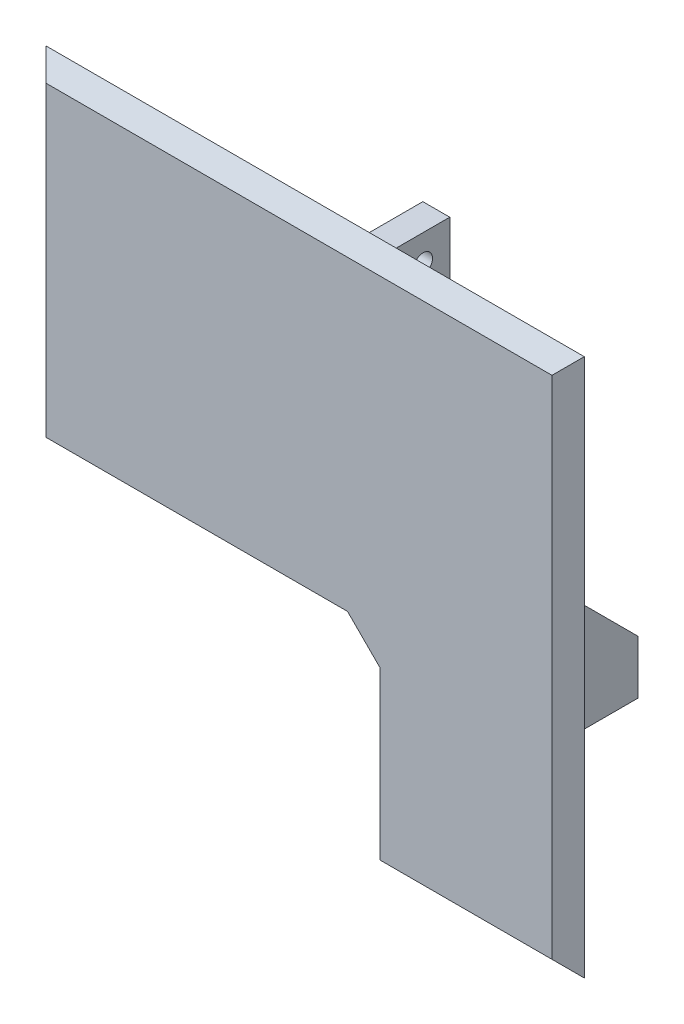
ISO-10303-21;
HEADER;
FILE_DESCRIPTION(('STEP AP214'),'2;1');
FILE_NAME('part.step','',(''),(''),'','','');
FILE_SCHEMA(('AUTOMOTIVE_DESIGN { 1 0 10303 214 1 1 1 1 }'));
ENDSEC;
DATA;
#1=APPLICATION_CONTEXT('core data for automotive mechanical design processes');
#2=APPLICATION_PROTOCOL_DEFINITION('international standard','automotive_design',2000,#1);
#3=PRODUCT_CONTEXT('',#1,'mechanical');
#4=PRODUCT('Part','Part','',(#3));
#5=PRODUCT_RELATED_PRODUCT_CATEGORY('part','',(#4));
#6=PRODUCT_DEFINITION_FORMATION('','',#4);
#7=PRODUCT_DEFINITION_CONTEXT('part definition',#1,'design');
#8=PRODUCT_DEFINITION('design','',#6,#7);
#9=PRODUCT_DEFINITION_SHAPE('','',#8);
#10=(LENGTH_UNIT() NAMED_UNIT(*) SI_UNIT(.MILLI.,.METRE.));
#11=(NAMED_UNIT(*) PLANE_ANGLE_UNIT() SI_UNIT($,.RADIAN.));
#12=(NAMED_UNIT(*) SI_UNIT($,.STERADIAN.) SOLID_ANGLE_UNIT());
#13=UNCERTAINTY_MEASURE_WITH_UNIT(LENGTH_MEASURE(1.E-05),#10,'distance_accuracy_value','');
#14=(GEOMETRIC_REPRESENTATION_CONTEXT(3) GLOBAL_UNCERTAINTY_ASSIGNED_CONTEXT((#13)) GLOBAL_UNIT_ASSIGNED_CONTEXT((#10,
#11,#12)) REPRESENTATION_CONTEXT('',''));
#15=CARTESIAN_POINT('',(0.,0.,0.));
#16=DIRECTION('',(0.,0.,1.));
#17=DIRECTION('',(1.,0.,0.));
#18=AXIS2_PLACEMENT_3D('',#15,#16,#17);
#19=CARTESIAN_POINT('',(0.,0.,3.));
#20=DIRECTION('',(0.,0.,-1.));
#21=DIRECTION('',(1.,0.,0.));
#22=AXIS2_PLACEMENT_3D('',#19,#20,#21);
#23=PLANE('',#22);
#24=DIRECTION('',(-1.,0.,0.));
#25=VECTOR('',#24,1.);
#26=CARTESIAN_POINT('',(65.,99.95,3.));
#27=LINE('',#26,#25);
#28=CARTESIAN_POINT('',(65.,99.95,3.));
#29=VERTEX_POINT('',#28);
#30=CARTESIAN_POINT('',(60.,99.95,3.));
#31=VERTEX_POINT('',#30);
#32=EDGE_CURVE('E245',#29,#31,#27,.T.);
#33=ORIENTED_EDGE('',*,*,#32,.T.);
#34=DIRECTION('',(0.,-1.,0.));
#35=VECTOR('',#34,1.);
#36=CARTESIAN_POINT('',(60.,99.95,3.));
#37=LINE('',#36,#35);
#38=CARTESIAN_POINT('',(60.,89.95,3.));
#39=VERTEX_POINT('',#38);
#40=EDGE_CURVE('E248',#31,#39,#37,.T.);
#41=ORIENTED_EDGE('',*,*,#40,.T.);
#42=DIRECTION('',(1.,0.,0.));
#43=VECTOR('',#42,1.);
#44=CARTESIAN_POINT('',(65.,89.95,3.));
#45=LINE('',#44,#43);
#46=CARTESIAN_POINT('',(65.,89.95,3.));
#47=VERTEX_POINT('',#46);
#48=EDGE_CURVE('E233',#39,#47,#45,.T.);
#49=ORIENTED_EDGE('',*,*,#48,.T.);
#50=DIRECTION('',(0.,1.,0.));
#51=VECTOR('',#50,1.);
#52=CARTESIAN_POINT('',(65.,99.95,3.));
#53=LINE('',#52,#51);
#54=EDGE_CURVE('E242',#47,#29,#53,.T.);
#55=ORIENTED_EDGE('',*,*,#54,.T.);
#56=EDGE_LOOP('',(#33,#41,#49,#55));
#57=FACE_BOUND('',#56,.T.);
#58=DIRECTION('',(1.,0.,0.));
#59=VECTOR('',#58,1.);
#60=CARTESIAN_POINT('',(89.95,40.,3.));
#61=LINE('',#60,#59);
#62=CARTESIAN_POINT('',(89.95,40.,3.));
#63=VERTEX_POINT('',#62);
#64=CARTESIAN_POINT('',(99.95,40.,3.));
#65=VERTEX_POINT('',#64);
#66=EDGE_CURVE('E284',#63,#65,#61,.T.);
#67=ORIENTED_EDGE('',*,*,#66,.T.);
#68=DIRECTION('',(0.,1.,0.));
#69=VECTOR('',#68,1.);
#70=CARTESIAN_POINT('',(99.95,60.,3.));
#71=LINE('',#70,#69);
#72=CARTESIAN_POINT('',(99.95,60.,3.));
#73=VERTEX_POINT('',#72);
#74=EDGE_CURVE('E287',#65,#73,#71,.T.);
#75=ORIENTED_EDGE('',*,*,#74,.T.);
#76=DIRECTION('',(-1.,0.,0.));
#77=VECTOR('',#76,1.);
#78=CARTESIAN_POINT('',(89.95,60.,3.));
#79=LINE('',#78,#77);
#80=CARTESIAN_POINT('',(89.95,60.,3.));
#81=VERTEX_POINT('',#80);
#82=EDGE_CURVE('E274',#73,#81,#79,.T.);
#83=ORIENTED_EDGE('',*,*,#82,.T.);
#84=DIRECTION('',(0.,-1.,0.));
#85=VECTOR('',#84,1.);
#86=CARTESIAN_POINT('',(89.95,60.,3.));
#87=LINE('',#86,#85);
#88=EDGE_CURVE('E281',#81,#63,#87,.T.);
#89=ORIENTED_EDGE('',*,*,#88,.T.);
#90=EDGE_LOOP('',(#67,#75,#83,#89));
#91=FACE_BOUND('',#90,.T.);
#92=DIRECTION('',(1.,0.,0.));
#93=VECTOR('',#92,1.);
#94=CARTESIAN_POINT('',(65.,40.,3.));
#95=LINE('',#94,#93);
#96=CARTESIAN_POINT('',(0.,40.,3.));
#97=VERTEX_POINT('',#96);
#98=CARTESIAN_POINT('',(0.0499999999999806,40.,3.));
#99=VERTEX_POINT('',#98);
#100=EDGE_CURVE('E220',#97,#99,#95,.T.);
#101=ORIENTED_EDGE('',*,*,#100,.F.);
#102=DIRECTION('',(0.,-1.,0.));
#103=VECTOR('',#102,1.);
#104=CARTESIAN_POINT('',(0.,100.,3.));
#105=LINE('',#104,#103);
#106=CARTESIAN_POINT('',(0.,100.,3.));
#107=VERTEX_POINT('',#106);
#108=EDGE_CURVE('E319',#107,#97,#105,.T.);
#109=ORIENTED_EDGE('',*,*,#108,.F.);
#110=DIRECTION('',(-1.,0.,0.));
#111=VECTOR('',#110,1.);
#112=CARTESIAN_POINT('',(0.,100.,3.));
#113=LINE('',#112,#111);
#114=CARTESIAN_POINT('',(100.,100.,3.));
#115=VERTEX_POINT('',#114);
#116=EDGE_CURVE('E327',#115,#107,#113,.T.);
#117=ORIENTED_EDGE('',*,*,#116,.F.);
#118=DIRECTION('',(0.,1.,0.));
#119=VECTOR('',#118,1.);
#120=CARTESIAN_POINT('',(100.,100.,3.));
#121=LINE('',#120,#119);
#122=CARTESIAN_POINT('',(100.,0.,3.));
#123=VERTEX_POINT('',#122);
#124=EDGE_CURVE('E324',#123,#115,#121,.T.);
#125=ORIENTED_EDGE('',*,*,#124,.F.);
#126=DIRECTION('',(1.,0.,0.));
#127=VECTOR('',#126,1.);
#128=CARTESIAN_POINT('',(0.,0.,3.));
#129=LINE('',#128,#127);
#130=CARTESIAN_POINT('',(65.,0.,3.));
#131=VERTEX_POINT('',#130);
#132=EDGE_CURVE('E322',#131,#123,#129,.T.);
#133=ORIENTED_EDGE('',*,*,#132,.F.);
#134=DIRECTION('',(0.,-1.,0.));
#135=VECTOR('',#134,1.);
#136=CARTESIAN_POINT('',(65.,40.,3.));
#137=LINE('',#136,#135);
#138=CARTESIAN_POINT('',(65.,34.,3.));
#139=VERTEX_POINT('',#138);
#140=EDGE_CURVE('E211',#139,#131,#137,.T.);
#141=ORIENTED_EDGE('',*,*,#140,.F.);
#142=DIRECTION('',(0.707106781186543,-0.707106781186552,0.));
#143=VECTOR('',#142,1.);
#144=CARTESIAN_POINT('',(65.,34.,3.));
#145=LINE('',#144,#143);
#146=CARTESIAN_POINT('',(59.,40.,3.));
#147=VERTEX_POINT('',#146);
#148=EDGE_CURVE('E41',#139,#147,#145,.F.);
#149=ORIENTED_EDGE('',*,*,#148,.T.);
#150=CARTESIAN_POINT('',(10.05,40.,3.));
#151=VERTEX_POINT('',#150);
#152=EDGE_CURVE('E213',#151,#147,#95,.T.);
#153=ORIENTED_EDGE('',*,*,#152,.F.);
#154=DIRECTION('',(0.,1.,0.));
#155=VECTOR('',#154,1.);
#156=CARTESIAN_POINT('',(10.05,60.,3.));
#157=LINE('',#156,#155);
#158=CARTESIAN_POINT('',(10.05,60.,3.));
#159=VERTEX_POINT('',#158);
#160=EDGE_CURVE('E309',#151,#159,#157,.T.);
#161=ORIENTED_EDGE('',*,*,#160,.T.);
#162=DIRECTION('',(-1.,0.,0.));
#163=VECTOR('',#162,1.);
#164=CARTESIAN_POINT('',(0.0499999999999793,60.,3.));
#165=LINE('',#164,#163);
#166=CARTESIAN_POINT('',(0.0499999999999793,60.,3.));
#167=VERTEX_POINT('',#166);
#168=EDGE_CURVE('E300',#159,#167,#165,.T.);
#169=ORIENTED_EDGE('',*,*,#168,.T.);
#170=DIRECTION('',(0.,-1.,0.));
#171=VECTOR('',#170,1.);
#172=CARTESIAN_POINT('',(0.0499999999999793,60.,3.));
#173=LINE('',#172,#171);
#174=EDGE_CURVE('E295',#167,#99,#173,.T.);
#175=ORIENTED_EDGE('',*,*,#174,.T.);
#176=EDGE_LOOP('',(#101,#109,#117,#125,#133,#141,#149,#153,#161,#169,#175));
#177=FACE_BOUND('',#176,.T.);
#178=DIRECTION('',(1.,0.,0.));
#179=VECTOR('',#178,1.);
#180=CARTESIAN_POINT('',(65.05,10.05,3.));
#181=LINE('',#180,#179);
#182=CARTESIAN_POINT('',(65.05,10.05,3.));
#183=VERTEX_POINT('',#182);
#184=CARTESIAN_POINT('',(70.05,10.05,3.));
#185=VERTEX_POINT('',#184);
#186=EDGE_CURVE('E725',#183,#185,#181,.T.);
#187=ORIENTED_EDGE('',*,*,#186,.F.);
#188=DIRECTION('',(0.,1.,0.));
#189=VECTOR('',#188,1.);
#190=CARTESIAN_POINT('',(65.05,0.0500000000000001,3.));
#191=LINE('',#190,#189);
#192=CARTESIAN_POINT('',(65.05,0.0500000000000001,3.));
#193=VERTEX_POINT('',#192);
#194=EDGE_CURVE('E209',#193,#183,#191,.T.);
#195=ORIENTED_EDGE('',*,*,#194,.F.);
#196=DIRECTION('',(-1.,0.,0.));
#197=VECTOR('',#196,1.);
#198=CARTESIAN_POINT('',(65.05,0.0500000000000001,3.));
#199=LINE('',#198,#197);
#200=CARTESIAN_POINT('',(70.05,0.0499999999999994,3.));
#201=VERTEX_POINT('',#200);
#202=EDGE_CURVE('E205',#201,#193,#199,.T.);
#203=ORIENTED_EDGE('',*,*,#202,.F.);
#204=DIRECTION('',(0.,-1.,0.));
#205=VECTOR('',#204,1.);
#206=CARTESIAN_POINT('',(70.05,0.0499999999999994,3.));
#207=LINE('',#206,#205);
#208=EDGE_CURVE('E722',#185,#201,#207,.T.);
#209=ORIENTED_EDGE('',*,*,#208,.F.);
#210=EDGE_LOOP('',(#187,#195,#203,#209));
#211=FACE_BOUND('',#210,.T.);
#212=ADVANCED_FACE('F33',(#57,#91,#177,#211),#23,.T.);
#213=CARTESIAN_POINT('',(0.,0.,6.));
#214=DIRECTION('',(0.,0.,-1.));
#215=DIRECTION('',(1.,0.,0.));
#216=AXIS2_PLACEMENT_3D('',#213,#214,#215);
#217=PLANE('',#216);
#218=DIRECTION('',(1.,0.,0.));
#219=VECTOR('',#218,1.);
#220=CARTESIAN_POINT('',(0.,40.,6.));
#221=LINE('',#220,#219);
#222=CARTESIAN_POINT('',(3.00000000000001,40.,6.));
#223=VERTEX_POINT('',#222);
#224=CARTESIAN_POINT('',(59.,40.,6.));
#225=VERTEX_POINT('',#224);
#226=EDGE_CURVE('E223',#223,#225,#221,.T.);
#227=ORIENTED_EDGE('',*,*,#226,.T.);
#228=DIRECTION('',(-0.707106781186543,0.707106781186552,0.));
#229=VECTOR('',#228,1.);
#230=CARTESIAN_POINT('',(49.5000000000004,49.4999999999998,6.));
#231=LINE('',#230,#229);
#232=CARTESIAN_POINT('',(65.,34.,6.));
#233=VERTEX_POINT('',#232);
#234=EDGE_CURVE('E11',#225,#233,#231,.F.);
#235=ORIENTED_EDGE('',*,*,#234,.T.);
#236=DIRECTION('',(0.,-1.,0.));
#237=VECTOR('',#236,1.);
#238=CARTESIAN_POINT('',(65.,0.,6.));
#239=LINE('',#238,#237);
#240=CARTESIAN_POINT('',(65.,3.00000000000002,6.));
#241=VERTEX_POINT('',#240);
#242=EDGE_CURVE('E221',#233,#241,#239,.T.);
#243=ORIENTED_EDGE('',*,*,#242,.T.);
#244=DIRECTION('',(-1.,0.,0.));
#245=VECTOR('',#244,1.);
#246=CARTESIAN_POINT('',(0.,3.00000000000002,6.));
#247=LINE('',#246,#245);
#248=CARTESIAN_POINT('',(97.,3.00000000000002,6.));
#249=VERTEX_POINT('',#248);
#250=EDGE_CURVE('E356',#249,#241,#247,.T.);
#251=ORIENTED_EDGE('',*,*,#250,.F.);
#252=DIRECTION('',(0.,-1.,0.));
#253=VECTOR('',#252,1.);
#254=CARTESIAN_POINT('',(97.,0.,6.));
#255=LINE('',#254,#253);
#256=CARTESIAN_POINT('',(97.,97.,6.));
#257=VERTEX_POINT('',#256);
#258=EDGE_CURVE('E353',#257,#249,#255,.T.);
#259=ORIENTED_EDGE('',*,*,#258,.F.);
#260=DIRECTION('',(1.,0.,0.));
#261=VECTOR('',#260,1.);
#262=CARTESIAN_POINT('',(0.,97.,6.));
#263=LINE('',#262,#261);
#264=CARTESIAN_POINT('',(3.,97.,6.));
#265=VERTEX_POINT('',#264);
#266=EDGE_CURVE('E350',#265,#257,#263,.T.);
#267=ORIENTED_EDGE('',*,*,#266,.F.);
#268=DIRECTION('',(0.,1.,0.));
#269=VECTOR('',#268,1.);
#270=CARTESIAN_POINT('',(3.00000000000002,0.,6.));
#271=LINE('',#270,#269);
#272=EDGE_CURVE('E344',#223,#265,#271,.T.);
#273=ORIENTED_EDGE('',*,*,#272,.F.);
#274=EDGE_LOOP('',(#227,#235,#243,#251,#259,#267,#273));
#275=FACE_BOUND('',#274,.T.);
#276=ADVANCED_FACE('F399',(#275),#217,.F.);
#277=CARTESIAN_POINT('',(0.0499999999999793,60.,-7.));
#278=DIRECTION('',(1.,0.,0.));
#279=DIRECTION('',(0.,1.,0.));
#280=AXIS2_PLACEMENT_3D('',#277,#278,#279);
#281=PLANE('',#280);
#282=DIRECTION('',(0.,-1.,0.));
#283=VECTOR('',#282,1.);
#284=CARTESIAN_POINT('',(0.0499999999999793,60.,-7.));
#285=LINE('',#284,#283);
#286=CARTESIAN_POINT('',(0.0499999999999806,50.,-7.));
#287=VERTEX_POINT('',#286);
#288=CARTESIAN_POINT('',(0.0499999999999819,40.,-7.));
#289=VERTEX_POINT('',#288);
#290=EDGE_CURVE('E296',#287,#289,#285,.T.);
#291=ORIENTED_EDGE('',*,*,#290,.T.);
#292=DIRECTION('',(0.,0.,1.));
#293=VECTOR('',#292,1.);
#294=CARTESIAN_POINT('',(0.0499999999999819,40.,-7.));
#295=LINE('',#294,#293);
#296=EDGE_CURVE('E316',#289,#99,#295,.T.);
#297=ORIENTED_EDGE('',*,*,#296,.T.);
#298=ORIENTED_EDGE('',*,*,#174,.F.);
#299=DIRECTION('',(0.,0.707106781186547,0.707106781186549));
#300=VECTOR('',#299,1.);
#301=CARTESIAN_POINT('',(0.0499999999999806,50.,-7.));
#302=LINE('',#301,#300);
#303=EDGE_CURVE('E339',#287,#167,#302,.T.);
#304=ORIENTED_EDGE('',*,*,#303,.F.);
#305=EDGE_LOOP('',(#291,#297,#298,#304));
#306=FACE_BOUND('',#305,.T.);
#307=ADVANCED_FACE('F415',(#306),#281,.F.);
#308=CARTESIAN_POINT('',(0.0499999999999819,40.,-7.));
#309=DIRECTION('',(0.,1.,0.));
#310=DIRECTION('',(0.,0.,-1.));
#311=AXIS2_PLACEMENT_3D('',#308,#309,#310);
#312=PLANE('',#311);
#313=CARTESIAN_POINT('',(5.04622786455411,40.,-2.));
#314=DIRECTION('',(0.,1.,0.));
#315=DIRECTION('',(0.,0.,1.));
#316=AXIS2_PLACEMENT_3D('',#313,#314,#315);
#317=CIRCLE('',#316,1.525);
#318=CARTESIAN_POINT('',(5.04622786455411,40.,-0.474999999999999));
#319=VERTEX_POINT('',#318);
#320=EDGE_CURVE('E266',#319,#319,#317,.T.);
#321=ORIENTED_EDGE('',*,*,#320,.T.);
#322=EDGE_LOOP('',(#321));
#323=FACE_BOUND('',#322,.T.);
#324=ORIENTED_EDGE('',*,*,#152,.T.);
#325=DIRECTION('',(0.,0.,1.));
#326=VECTOR('',#325,1.);
#327=CARTESIAN_POINT('',(59.,40.,6.));
#328=LINE('',#327,#326);
#329=EDGE_CURVE('E48',#147,#225,#328,.T.);
#330=ORIENTED_EDGE('',*,*,#329,.T.);
#331=ORIENTED_EDGE('',*,*,#226,.F.);
#332=DIRECTION('',(0.707106781186549,0.,0.707106781186546));
#333=VECTOR('',#332,1.);
#334=CARTESIAN_POINT('',(0.,40.,2.99999999999999));
#335=LINE('',#334,#333);
#336=EDGE_CURVE('E370',#223,#97,#335,.F.);
#337=ORIENTED_EDGE('',*,*,#336,.T.);
#338=ORIENTED_EDGE('',*,*,#100,.T.);
#339=ORIENTED_EDGE('',*,*,#296,.F.);
#340=DIRECTION('',(1.,0.,0.));
#341=VECTOR('',#340,1.);
#342=CARTESIAN_POINT('',(0.0499999999999819,40.,-7.));
#343=LINE('',#342,#341);
#344=CARTESIAN_POINT('',(10.05,40.,-7.));
#345=VERTEX_POINT('',#344);
#346=EDGE_CURVE('E299',#289,#345,#343,.T.);
#347=ORIENTED_EDGE('',*,*,#346,.T.);
#348=DIRECTION('',(0.,0.,1.));
#349=VECTOR('',#348,1.);
#350=CARTESIAN_POINT('',(10.05,40.,-7.));
#351=LINE('',#350,#349);
#352=EDGE_CURVE('E306',#345,#151,#351,.T.);
#353=ORIENTED_EDGE('',*,*,#352,.T.);
#354=EDGE_LOOP('',(#324,#330,#331,#337,#338,#339,#347,#353));
#355=FACE_BOUND('',#354,.T.);
#356=ADVANCED_FACE('F450',(#323,#355),#312,.F.);
#357=CARTESIAN_POINT('',(10.05,60.,-7.));
#358=DIRECTION('',(-1.,0.,0.));
#359=DIRECTION('',(0.,0.,-1.));
#360=AXIS2_PLACEMENT_3D('',#357,#358,#359);
#361=PLANE('',#360);
#362=ORIENTED_EDGE('',*,*,#160,.F.);
#363=ORIENTED_EDGE('',*,*,#352,.F.);
#364=DIRECTION('',(0.,1.,0.));
#365=VECTOR('',#364,1.);
#366=CARTESIAN_POINT('',(10.05,60.,-7.));
#367=LINE('',#366,#365);
#368=CARTESIAN_POINT('',(10.05,50.,-7.));
#369=VERTEX_POINT('',#368);
#370=EDGE_CURVE('E303',#345,#369,#367,.T.);
#371=ORIENTED_EDGE('',*,*,#370,.T.);
#372=DIRECTION('',(0.,-0.707106781186547,-0.707106781186549));
#373=VECTOR('',#372,1.);
#374=CARTESIAN_POINT('',(10.05,50.,-7.));
#375=LINE('',#374,#373);
#376=EDGE_CURVE('E341',#159,#369,#375,.T.);
#377=ORIENTED_EDGE('',*,*,#376,.F.);
#378=EDGE_LOOP('',(#362,#363,#371,#377));
#379=FACE_BOUND('',#378,.T.);
#380=ADVANCED_FACE('F462',(#379),#361,.F.);
#381=CARTESIAN_POINT('',(0.,0.,-7.));
#382=DIRECTION('',(0.,0.,-1.));
#383=DIRECTION('',(1.,0.,0.));
#384=AXIS2_PLACEMENT_3D('',#381,#382,#383);
#385=PLANE('',#384);
#386=ORIENTED_EDGE('',*,*,#370,.F.);
#387=ORIENTED_EDGE('',*,*,#346,.F.);
#388=ORIENTED_EDGE('',*,*,#290,.F.);
#389=DIRECTION('',(-1.,0.,0.));
#390=VECTOR('',#389,1.);
#391=CARTESIAN_POINT('',(0.0499999999999793,50.,-7.));
#392=LINE('',#391,#390);
#393=EDGE_CURVE('E337',#369,#287,#392,.T.);
#394=ORIENTED_EDGE('',*,*,#393,.F.);
#395=EDGE_LOOP('',(#386,#387,#388,#394));
#396=FACE_BOUND('',#395,.T.);
#397=ADVANCED_FACE('F460',(#396),#385,.T.);
#398=CARTESIAN_POINT('',(89.95,60.,-7.));
#399=DIRECTION('',(1.,0.,0.));
#400=DIRECTION('',(0.,1.,0.));
#401=AXIS2_PLACEMENT_3D('',#398,#399,#400);
#402=PLANE('',#401);
#403=DIRECTION('',(0.,-1.,0.));
#404=VECTOR('',#403,1.);
#405=CARTESIAN_POINT('',(89.95,60.,-7.));
#406=LINE('',#405,#404);
#407=CARTESIAN_POINT('',(89.95,50.,-7.));
#408=VERTEX_POINT('',#407);
#409=CARTESIAN_POINT('',(89.95,40.,-7.));
#410=VERTEX_POINT('',#409);
#411=EDGE_CURVE('E270',#408,#410,#406,.T.);
#412=ORIENTED_EDGE('',*,*,#411,.T.);
#413=DIRECTION('',(0.,0.,1.));
#414=VECTOR('',#413,1.);
#415=CARTESIAN_POINT('',(89.95,40.,-7.));
#416=LINE('',#415,#414);
#417=EDGE_CURVE('E293',#410,#63,#416,.T.);
#418=ORIENTED_EDGE('',*,*,#417,.T.);
#419=ORIENTED_EDGE('',*,*,#88,.F.);
#420=DIRECTION('',(0.,0.707106781186547,0.707106781186549));
#421=VECTOR('',#420,1.);
#422=CARTESIAN_POINT('',(89.95,50.,-7.00000000000003));
#423=LINE('',#422,#421);
#424=EDGE_CURVE('E332',#408,#81,#423,.T.);
#425=ORIENTED_EDGE('',*,*,#424,.F.);
#426=EDGE_LOOP('',(#412,#418,#419,#425));
#427=FACE_BOUND('',#426,.T.);
#428=ADVANCED_FACE('F470',(#427),#402,.F.);
#429=CARTESIAN_POINT('',(89.95,40.,-7.));
#430=DIRECTION('',(0.,1.,0.));
#431=DIRECTION('',(0.,0.,-1.));
#432=AXIS2_PLACEMENT_3D('',#429,#430,#431);
#433=PLANE('',#432);
#434=CARTESIAN_POINT('',(94.95,40.,-2.));
#435=DIRECTION('',(0.,1.,0.));
#436=DIRECTION('',(0.,0.,1.));
#437=AXIS2_PLACEMENT_3D('',#434,#435,#436);
#438=CIRCLE('',#437,1.525);
#439=CARTESIAN_POINT('',(94.95,40.,-0.475000000000004));
#440=VERTEX_POINT('',#439);
#441=EDGE_CURVE('E261',#440,#440,#438,.T.);
#442=ORIENTED_EDGE('',*,*,#441,.T.);
#443=EDGE_LOOP('',(#442));
#444=FACE_BOUND('',#443,.T.);
#445=ORIENTED_EDGE('',*,*,#66,.F.);
#446=ORIENTED_EDGE('',*,*,#417,.F.);
#447=DIRECTION('',(1.,0.,0.));
#448=VECTOR('',#447,1.);
#449=CARTESIAN_POINT('',(89.95,40.,-7.));
#450=LINE('',#449,#448);
#451=CARTESIAN_POINT('',(99.95,40.,-7.));
#452=VERTEX_POINT('',#451);
#453=EDGE_CURVE('E273',#410,#452,#450,.T.);
#454=ORIENTED_EDGE('',*,*,#453,.T.);
#455=DIRECTION('',(0.,0.,1.));
#456=VECTOR('',#455,1.);
#457=CARTESIAN_POINT('',(99.95,40.,-7.));
#458=LINE('',#457,#456);
#459=EDGE_CURVE('E280',#452,#65,#458,.T.);
#460=ORIENTED_EDGE('',*,*,#459,.T.);
#461=EDGE_LOOP('',(#445,#446,#454,#460));
#462=FACE_BOUND('',#461,.T.);
#463=ADVANCED_FACE('F477',(#444,#462),#433,.F.);
#464=CARTESIAN_POINT('',(99.95,60.,-7.));
#465=DIRECTION('',(-1.,0.,0.));
#466=DIRECTION('',(0.,0.,-1.));
#467=AXIS2_PLACEMENT_3D('',#464,#465,#466);
#468=PLANE('',#467);
#469=ORIENTED_EDGE('',*,*,#74,.F.);
#470=ORIENTED_EDGE('',*,*,#459,.F.);
#471=DIRECTION('',(0.,1.,0.));
#472=VECTOR('',#471,1.);
#473=CARTESIAN_POINT('',(99.95,60.,-7.));
#474=LINE('',#473,#472);
#475=CARTESIAN_POINT('',(99.95,50.,-7.));
#476=VERTEX_POINT('',#475);
#477=EDGE_CURVE('E277',#452,#476,#474,.T.);
#478=ORIENTED_EDGE('',*,*,#477,.T.);
#479=DIRECTION('',(0.,-0.707106781186547,-0.707106781186549));
#480=VECTOR('',#479,1.);
#481=CARTESIAN_POINT('',(99.95,50.,-7.));
#482=LINE('',#481,#480);
#483=EDGE_CURVE('E334',#73,#476,#482,.T.);
#484=ORIENTED_EDGE('',*,*,#483,.F.);
#485=EDGE_LOOP('',(#469,#470,#478,#484));
#486=FACE_BOUND('',#485,.T.);
#487=ADVANCED_FACE('F481',(#486),#468,.F.);
#488=CARTESIAN_POINT('',(0.,0.,-7.));
#489=DIRECTION('',(0.,0.,-1.));
#490=DIRECTION('',(1.,0.,0.));
#491=AXIS2_PLACEMENT_3D('',#488,#489,#490);
#492=PLANE('',#491);
#493=ORIENTED_EDGE('',*,*,#477,.F.);
#494=ORIENTED_EDGE('',*,*,#453,.F.);
#495=ORIENTED_EDGE('',*,*,#411,.F.);
#496=DIRECTION('',(-1.,0.,0.));
#497=VECTOR('',#496,1.);
#498=CARTESIAN_POINT('',(89.95,50.,-7.));
#499=LINE('',#498,#497);
#500=EDGE_CURVE('E330',#476,#408,#499,.T.);
#501=ORIENTED_EDGE('',*,*,#500,.F.);
#502=EDGE_LOOP('',(#493,#494,#495,#501));
#503=FACE_BOUND('',#502,.T.);
#504=ADVANCED_FACE('F425',(#503),#492,.T.);
#505=CARTESIAN_POINT('',(0.,50.,-7.));
#506=DIRECTION('',(0.,0.707106781186548,-0.707106781186546));
#507=DIRECTION('',(1.,0.,0.));
#508=AXIS2_PLACEMENT_3D('',#505,#506,#507);
#509=PLANE('',#508);
#510=CARTESIAN_POINT('',(94.95,55.,-2.));
#511=DIRECTION('',(0.,-0.707106781186548,0.707106781186546));
#512=DIRECTION('',(0.,-0.707106781186547,-0.707106781186549));
#513=AXIS2_PLACEMENT_3D('',#510,#511,#512);
#514=ELLIPSE('',#513,2.15667568261896,1.525);
#515=CARTESIAN_POINT('',(94.95,53.475,-3.525));
#516=VERTEX_POINT('',#515);
#517=EDGE_CURVE('E264',#516,#516,#514,.T.);
#518=ORIENTED_EDGE('',*,*,#517,.T.);
#519=EDGE_LOOP('',(#518));
#520=FACE_BOUND('',#519,.T.);
#521=ORIENTED_EDGE('',*,*,#483,.T.);
#522=ORIENTED_EDGE('',*,*,#500,.T.);
#523=ORIENTED_EDGE('',*,*,#424,.T.);
#524=ORIENTED_EDGE('',*,*,#82,.F.);
#525=EDGE_LOOP('',(#521,#522,#523,#524));
#526=FACE_BOUND('',#525,.T.);
#527=ADVANCED_FACE('F421',(#520,#526),#509,.T.);
#528=CARTESIAN_POINT('',(0.,50.,-7.));
#529=DIRECTION('',(0.,0.707106781186548,-0.707106781186546));
#530=DIRECTION('',(1.,0.,0.));
#531=AXIS2_PLACEMENT_3D('',#528,#529,#530);
#532=PLANE('',#531);
#533=CARTESIAN_POINT('',(5.04622786455411,55.,-2.));
#534=DIRECTION('',(0.,-0.707106781186548,0.707106781186546));
#535=DIRECTION('',(0.,-0.707106781186547,-0.707106781186549));
#536=AXIS2_PLACEMENT_3D('',#533,#534,#535);
#537=ELLIPSE('',#536,2.15667568261897,1.525);
#538=CARTESIAN_POINT('',(5.04622786455411,53.475,-3.525));
#539=VERTEX_POINT('',#538);
#540=EDGE_CURVE('E269',#539,#539,#537,.T.);
#541=ORIENTED_EDGE('',*,*,#540,.T.);
#542=EDGE_LOOP('',(#541));
#543=FACE_BOUND('',#542,.T.);
#544=ORIENTED_EDGE('',*,*,#376,.T.);
#545=ORIENTED_EDGE('',*,*,#393,.T.);
#546=ORIENTED_EDGE('',*,*,#303,.T.);
#547=ORIENTED_EDGE('',*,*,#168,.F.);
#548=EDGE_LOOP('',(#544,#545,#546,#547));
#549=FACE_BOUND('',#548,.T.);
#550=ADVANCED_FACE('F424',(#543,#549),#532,.T.);
#551=CARTESIAN_POINT('',(5.04622786455411,100.,-2.));
#552=DIRECTION('',(0.,-1.,0.));
#553=DIRECTION('',(0.,0.,1.));
#554=AXIS2_PLACEMENT_3D('',#551,#552,#553);
#555=CYLINDRICAL_SURFACE('',#554,1.525);
#556=ORIENTED_EDGE('',*,*,#540,.F.);
#557=EDGE_LOOP('',(#556));
#558=FACE_BOUND('',#557,.T.);
#559=ORIENTED_EDGE('',*,*,#320,.F.);
#560=EDGE_LOOP('',(#559));
#561=FACE_BOUND('',#560,.T.);
#562=ADVANCED_FACE('F429',(#558,#561),#555,.F.);
#563=CARTESIAN_POINT('',(94.95,100.,-2.));
#564=DIRECTION('',(0.,-1.,0.));
#565=DIRECTION('',(0.,0.,1.));
#566=AXIS2_PLACEMENT_3D('',#563,#564,#565);
#567=CYLINDRICAL_SURFACE('',#566,1.525);
#568=ORIENTED_EDGE('',*,*,#517,.F.);
#569=EDGE_LOOP('',(#568));
#570=FACE_BOUND('',#569,.T.);
#571=ORIENTED_EDGE('',*,*,#441,.F.);
#572=EDGE_LOOP('',(#571));
#573=FACE_BOUND('',#572,.T.);
#574=ADVANCED_FACE('F441',(#570,#573),#567,.F.);
#575=CARTESIAN_POINT('',(0.,100.,3.));
#576=DIRECTION('',(0.,-0.707106781186546,-0.707106781186549));
#577=DIRECTION('',(-1.,0.,0.));
#578=AXIS2_PLACEMENT_3D('',#575,#576,#577);
#579=PLANE('',#578);
#580=DIRECTION('',(-0.577350269189627,-0.577350269189627,0.577350269189624));
#581=VECTOR('',#580,1.);
#582=CARTESIAN_POINT('',(66.6666666666666,66.6666666666666,36.3333333333333));
#583=LINE('',#582,#581);
#584=EDGE_CURVE('E362',#257,#115,#583,.F.);
#585=ORIENTED_EDGE('',*,*,#584,.T.);
#586=ORIENTED_EDGE('',*,*,#116,.T.);
#587=DIRECTION('',(0.577350269189627,-0.577350269189627,0.577350269189624));
#588=VECTOR('',#587,1.);
#589=CARTESIAN_POINT('',(0.,100.,3.));
#590=LINE('',#589,#588);
#591=EDGE_CURVE('E265',#107,#265,#590,.T.);
#592=ORIENTED_EDGE('',*,*,#591,.T.);
#593=ORIENTED_EDGE('',*,*,#266,.T.);
#594=EDGE_LOOP('',(#585,#586,#592,#593));
#595=FACE_BOUND('',#594,.T.);
#596=ADVANCED_FACE('F438',(#595),#579,.F.);
#597=CARTESIAN_POINT('',(0.,100.,3.));
#598=DIRECTION('',(0.707106781186546,0.,-0.707106781186549));
#599=DIRECTION('',(0.,-1.,0.));
#600=AXIS2_PLACEMENT_3D('',#597,#598,#599);
#601=PLANE('',#600);
#602=ORIENTED_EDGE('',*,*,#336,.F.);
#603=ORIENTED_EDGE('',*,*,#272,.T.);
#604=ORIENTED_EDGE('',*,*,#591,.F.);
#605=ORIENTED_EDGE('',*,*,#108,.T.);
#606=EDGE_LOOP('',(#602,#603,#604,#605));
#607=FACE_BOUND('',#606,.T.);
#608=ADVANCED_FACE('F436',(#607),#601,.F.);
#609=CARTESIAN_POINT('',(100.,100.,3.));
#610=DIRECTION('',(-0.707106781186546,0.,-0.707106781186549));
#611=DIRECTION('',(0.,1.,0.));
#612=AXIS2_PLACEMENT_3D('',#609,#610,#611);
#613=PLANE('',#612);
#614=ORIENTED_EDGE('',*,*,#584,.F.);
#615=ORIENTED_EDGE('',*,*,#258,.T.);
#616=DIRECTION('',(-0.577350269189627,0.577350269189627,0.577350269189624));
#617=VECTOR('',#616,1.);
#618=CARTESIAN_POINT('',(66.6666666666666,33.3333333333334,36.3333333333333));
#619=LINE('',#618,#617);
#620=EDGE_CURVE('E260',#249,#123,#619,.F.);
#621=ORIENTED_EDGE('',*,*,#620,.T.);
#622=ORIENTED_EDGE('',*,*,#124,.T.);
#623=EDGE_LOOP('',(#614,#615,#621,#622));
#624=FACE_BOUND('',#623,.T.);
#625=ADVANCED_FACE('F395',(#624),#613,.F.);
#626=CARTESIAN_POINT('',(0.,0.,3.));
#627=DIRECTION('',(0.,0.707106781186546,-0.707106781186549));
#628=DIRECTION('',(1.,0.,0.));
#629=AXIS2_PLACEMENT_3D('',#626,#627,#628);
#630=PLANE('',#629);
#631=DIRECTION('',(0.,-0.707106781186549,-0.707106781186546));
#632=VECTOR('',#631,1.);
#633=CARTESIAN_POINT('',(65.,0.,3.));
#634=LINE('',#633,#632);
#635=EDGE_CURVE('E359',#131,#241,#634,.F.);
#636=ORIENTED_EDGE('',*,*,#635,.F.);
#637=ORIENTED_EDGE('',*,*,#132,.T.);
#638=ORIENTED_EDGE('',*,*,#620,.F.);
#639=ORIENTED_EDGE('',*,*,#250,.T.);
#640=EDGE_LOOP('',(#636,#637,#638,#639));
#641=FACE_BOUND('',#640,.T.);
#642=ADVANCED_FACE('F392',(#641),#630,.F.);
#643=CARTESIAN_POINT('',(65.,99.95,-7.));
#644=DIRECTION('',(-1.,0.,0.));
#645=DIRECTION('',(0.,0.,-1.));
#646=AXIS2_PLACEMENT_3D('',#643,#644,#645);
#647=PLANE('',#646);
#648=CARTESIAN_POINT('',(65.,94.95,-2.05));
#649=DIRECTION('',(-1.,0.,0.));
#650=DIRECTION('',(0.,0.,1.));
#651=AXIS2_PLACEMENT_3D('',#648,#649,#650);
#652=CIRCLE('',#651,1.75);
#653=CARTESIAN_POINT('',(65.,94.95,-0.299999999999999));
#654=VERTEX_POINT('',#653);
#655=EDGE_CURVE('E225',#654,#654,#652,.T.);
#656=ORIENTED_EDGE('',*,*,#655,.T.);
#657=EDGE_LOOP('',(#656));
#658=FACE_BOUND('',#657,.T.);
#659=ORIENTED_EDGE('',*,*,#54,.F.);
#660=DIRECTION('',(0.,0.,1.));
#661=VECTOR('',#660,1.);
#662=CARTESIAN_POINT('',(65.,89.95,-7.));
#663=LINE('',#662,#661);
#664=CARTESIAN_POINT('',(65.,89.95,-7.));
#665=VERTEX_POINT('',#664);
#666=EDGE_CURVE('E241',#665,#47,#663,.T.);
#667=ORIENTED_EDGE('',*,*,#666,.F.);
#668=DIRECTION('',(0.,1.,0.));
#669=VECTOR('',#668,1.);
#670=CARTESIAN_POINT('',(65.,99.95,-7.));
#671=LINE('',#670,#669);
#672=CARTESIAN_POINT('',(65.,99.95,-7.));
#673=VERTEX_POINT('',#672);
#674=EDGE_CURVE('E229',#665,#673,#671,.T.);
#675=ORIENTED_EDGE('',*,*,#674,.T.);
#676=DIRECTION('',(0.,0.,1.));
#677=VECTOR('',#676,1.);
#678=CARTESIAN_POINT('',(65.,99.95,-7.));
#679=LINE('',#678,#677);
#680=EDGE_CURVE('E258',#673,#29,#679,.T.);
#681=ORIENTED_EDGE('',*,*,#680,.T.);
#682=EDGE_LOOP('',(#659,#667,#675,#681));
#683=FACE_BOUND('',#682,.T.);
#684=ADVANCED_FACE('F433',(#658,#683),#647,.F.);
#685=CARTESIAN_POINT('',(65.,99.95,-7.));
#686=DIRECTION('',(0.,-1.,0.));
#687=DIRECTION('',(0.,0.,1.));
#688=AXIS2_PLACEMENT_3D('',#685,#686,#687);
#689=PLANE('',#688);
#690=ORIENTED_EDGE('',*,*,#32,.F.);
#691=ORIENTED_EDGE('',*,*,#680,.F.);
#692=DIRECTION('',(-1.,0.,0.));
#693=VECTOR('',#692,1.);
#694=CARTESIAN_POINT('',(65.,99.95,-7.));
#695=LINE('',#694,#693);
#696=CARTESIAN_POINT('',(60.,99.95,-7.));
#697=VERTEX_POINT('',#696);
#698=EDGE_CURVE('E232',#673,#697,#695,.T.);
#699=ORIENTED_EDGE('',*,*,#698,.T.);
#700=DIRECTION('',(0.,0.,1.));
#701=VECTOR('',#700,1.);
#702=CARTESIAN_POINT('',(60.,99.95,-7.));
#703=LINE('',#702,#701);
#704=EDGE_CURVE('E256',#697,#31,#703,.T.);
#705=ORIENTED_EDGE('',*,*,#704,.T.);
#706=EDGE_LOOP('',(#690,#691,#699,#705));
#707=FACE_BOUND('',#706,.T.);
#708=ADVANCED_FACE('F494',(#707),#689,.F.);
#709=CARTESIAN_POINT('',(60.,99.95,-7.));
#710=DIRECTION('',(1.,0.,0.));
#711=DIRECTION('',(0.,1.,0.));
#712=AXIS2_PLACEMENT_3D('',#709,#710,#711);
#713=PLANE('',#712);
#714=CARTESIAN_POINT('',(60.,94.95,-2.05));
#715=DIRECTION('',(-1.,0.,0.));
#716=DIRECTION('',(0.,1.,0.));
#717=AXIS2_PLACEMENT_3D('',#714,#715,#716);
#718=CIRCLE('',#717,1.75);
#719=CARTESIAN_POINT('',(60.,96.7,-2.05));
#720=VERTEX_POINT('',#719);
#721=EDGE_CURVE('E228',#720,#720,#718,.T.);
#722=ORIENTED_EDGE('',*,*,#721,.F.);
#723=EDGE_LOOP('',(#722));
#724=FACE_BOUND('',#723,.T.);
#725=ORIENTED_EDGE('',*,*,#40,.F.);
#726=ORIENTED_EDGE('',*,*,#704,.F.);
#727=DIRECTION('',(0.,-1.,0.));
#728=VECTOR('',#727,1.);
#729=CARTESIAN_POINT('',(60.,99.95,-7.));
#730=LINE('',#729,#728);
#731=CARTESIAN_POINT('',(60.,89.95,-7.));
#732=VERTEX_POINT('',#731);
#733=EDGE_CURVE('E236',#697,#732,#730,.T.);
#734=ORIENTED_EDGE('',*,*,#733,.T.);
#735=DIRECTION('',(0.,0.,1.));
#736=VECTOR('',#735,1.);
#737=CARTESIAN_POINT('',(60.,89.95,-7.));
#738=LINE('',#737,#736);
#739=EDGE_CURVE('E254',#732,#39,#738,.T.);
#740=ORIENTED_EDGE('',*,*,#739,.T.);
#741=EDGE_LOOP('',(#725,#726,#734,#740));
#742=FACE_BOUND('',#741,.T.);
#743=ADVANCED_FACE('F498',(#724,#742),#713,.F.);
#744=CARTESIAN_POINT('',(65.,89.95,-7.));
#745=DIRECTION('',(0.,1.,0.));
#746=DIRECTION('',(-1.,0.,0.));
#747=AXIS2_PLACEMENT_3D('',#744,#745,#746);
#748=PLANE('',#747);
#749=ORIENTED_EDGE('',*,*,#48,.F.);
#750=ORIENTED_EDGE('',*,*,#739,.F.);
#751=DIRECTION('',(1.,0.,0.));
#752=VECTOR('',#751,1.);
#753=CARTESIAN_POINT('',(65.,89.95,-7.));
#754=LINE('',#753,#752);
#755=EDGE_CURVE('E239',#732,#665,#754,.T.);
#756=ORIENTED_EDGE('',*,*,#755,.T.);
#757=ORIENTED_EDGE('',*,*,#666,.T.);
#758=EDGE_LOOP('',(#749,#750,#756,#757));
#759=FACE_BOUND('',#758,.T.);
#760=ADVANCED_FACE('F502',(#759),#748,.F.);
#761=CARTESIAN_POINT('',(0.,0.,-7.));
#762=DIRECTION('',(0.,0.,1.));
#763=DIRECTION('',(-1.,0.,0.));
#764=AXIS2_PLACEMENT_3D('',#761,#762,#763);
#765=PLANE('',#764);
#766=ORIENTED_EDGE('',*,*,#674,.F.);
#767=ORIENTED_EDGE('',*,*,#755,.F.);
#768=ORIENTED_EDGE('',*,*,#733,.F.);
#769=ORIENTED_EDGE('',*,*,#698,.F.);
#770=EDGE_LOOP('',(#766,#767,#768,#769));
#771=FACE_BOUND('',#770,.T.);
#772=ADVANCED_FACE('F506',(#771),#765,.F.);
#773=CARTESIAN_POINT('',(55.,94.95,-2.05));
#774=DIRECTION('',(1.,0.,0.));
#775=DIRECTION('',(0.,0.,1.));
#776=AXIS2_PLACEMENT_3D('',#773,#774,#775);
#777=CYLINDRICAL_SURFACE('',#776,1.75);
#778=ORIENTED_EDGE('',*,*,#655,.F.);
#779=EDGE_LOOP('',(#778));
#780=FACE_BOUND('',#779,.T.);
#781=ORIENTED_EDGE('',*,*,#721,.T.);
#782=EDGE_LOOP('',(#781));
#783=FACE_BOUND('',#782,.T.);
#784=ADVANCED_FACE('F510',(#780,#783),#777,.F.);
#785=CARTESIAN_POINT('',(65.,40.,13.));
#786=DIRECTION('',(1.,0.,0.));
#787=DIRECTION('',(0.,0.,-1.));
#788=AXIS2_PLACEMENT_3D('',#785,#786,#787);
#789=PLANE('',#788);
#790=ORIENTED_EDGE('',*,*,#242,.F.);
#791=DIRECTION('',(0.,0.,-1.));
#792=VECTOR('',#791,1.);
#793=CARTESIAN_POINT('',(65.,34.,3.));
#794=LINE('',#793,#792);
#795=EDGE_CURVE('E372',#233,#139,#794,.T.);
#796=ORIENTED_EDGE('',*,*,#795,.T.);
#797=ORIENTED_EDGE('',*,*,#140,.T.);
#798=ORIENTED_EDGE('',*,*,#635,.T.);
#799=EDGE_LOOP('',(#790,#796,#797,#798));
#800=FACE_BOUND('',#799,.T.);
#801=ADVANCED_FACE('F382',(#800),#789,.F.);
#802=CARTESIAN_POINT('',(65.05,0.0500000000000001,-7.));
#803=DIRECTION('',(1.,0.,0.));
#804=DIRECTION('',(0.,0.,-1.));
#805=AXIS2_PLACEMENT_3D('',#802,#803,#804);
#806=PLANE('',#805);
#807=CARTESIAN_POINT('',(65.05,5.05,-2.));
#808=DIRECTION('',(-1.,0.,0.));
#809=DIRECTION('',(0.,0.,1.));
#810=AXIS2_PLACEMENT_3D('',#807,#808,#809);
#811=CIRCLE('',#810,1.75);
#812=CARTESIAN_POINT('',(65.05,5.05,-0.25));
#813=VERTEX_POINT('',#812);
#814=EDGE_CURVE('E376',#813,#813,#811,.T.);
#815=ORIENTED_EDGE('',*,*,#814,.F.);
#816=EDGE_LOOP('',(#815));
#817=FACE_BOUND('',#816,.T.);
#818=ORIENTED_EDGE('',*,*,#194,.T.);
#819=DIRECTION('',(0.,0.,1.));
#820=VECTOR('',#819,1.);
#821=CARTESIAN_POINT('',(65.05,10.05,-7.));
#822=LINE('',#821,#820);
#823=CARTESIAN_POINT('',(65.05,10.05,-7.));
#824=VERTEX_POINT('',#823);
#825=EDGE_CURVE('E189',#824,#183,#822,.T.);
#826=ORIENTED_EDGE('',*,*,#825,.F.);
#827=DIRECTION('',(0.,1.,0.));
#828=VECTOR('',#827,1.);
#829=CARTESIAN_POINT('',(65.05,0.0500000000000001,-7.));
#830=LINE('',#829,#828);
#831=CARTESIAN_POINT('',(65.05,0.0500000000000001,-7.));
#832=VERTEX_POINT('',#831);
#833=EDGE_CURVE('E196',#832,#824,#830,.T.);
#834=ORIENTED_EDGE('',*,*,#833,.F.);
#835=DIRECTION('',(0.,0.,1.));
#836=VECTOR('',#835,1.);
#837=CARTESIAN_POINT('',(65.05,0.0500000000000001,-7.));
#838=LINE('',#837,#836);
#839=EDGE_CURVE('E718',#832,#193,#838,.T.);
#840=ORIENTED_EDGE('',*,*,#839,.T.);
#841=EDGE_LOOP('',(#818,#826,#834,#840));
#842=FACE_BOUND('',#841,.T.);
#843=ADVANCED_FACE('F207',(#817,#842),#806,.F.);
#844=CARTESIAN_POINT('',(65.05,10.05,-7.));
#845=DIRECTION('',(0.,-1.,0.));
#846=DIRECTION('',(1.,0.,0.));
#847=AXIS2_PLACEMENT_3D('',#844,#845,#846);
#848=PLANE('',#847);
#849=ORIENTED_EDGE('',*,*,#186,.T.);
#850=DIRECTION('',(0.,0.,1.));
#851=VECTOR('',#850,1.);
#852=CARTESIAN_POINT('',(70.05,10.05,-7.));
#853=LINE('',#852,#851);
#854=CARTESIAN_POINT('',(70.05,10.05,-7.));
#855=VERTEX_POINT('',#854);
#856=EDGE_CURVE('E192',#855,#185,#853,.T.);
#857=ORIENTED_EDGE('',*,*,#856,.F.);
#858=DIRECTION('',(1.,0.,0.));
#859=VECTOR('',#858,1.);
#860=CARTESIAN_POINT('',(65.05,10.05,-7.));
#861=LINE('',#860,#859);
#862=EDGE_CURVE('E185',#824,#855,#861,.T.);
#863=ORIENTED_EDGE('',*,*,#862,.F.);
#864=ORIENTED_EDGE('',*,*,#825,.T.);
#865=EDGE_LOOP('',(#849,#857,#863,#864));
#866=FACE_BOUND('',#865,.T.);
#867=ADVANCED_FACE('F187',(#866),#848,.F.);
#868=CARTESIAN_POINT('',(70.05,0.0499999999999994,-7.));
#869=DIRECTION('',(-1.,0.,0.));
#870=DIRECTION('',(0.,0.,1.));
#871=AXIS2_PLACEMENT_3D('',#868,#869,#870);
#872=PLANE('',#871);
#873=CARTESIAN_POINT('',(70.05,5.05,-2.));
#874=DIRECTION('',(-1.,0.,0.));
#875=DIRECTION('',(0.,0.,1.));
#876=AXIS2_PLACEMENT_3D('',#873,#874,#875);
#877=CIRCLE('',#876,1.75);
#878=CARTESIAN_POINT('',(70.05,5.05,-0.25));
#879=VERTEX_POINT('',#878);
#880=EDGE_CURVE('E373',#879,#879,#877,.T.);
#881=ORIENTED_EDGE('',*,*,#880,.T.);
#882=EDGE_LOOP('',(#881));
#883=FACE_BOUND('',#882,.T.);
#884=ORIENTED_EDGE('',*,*,#208,.T.);
#885=DIRECTION('',(0.,0.,1.));
#886=VECTOR('',#885,1.);
#887=CARTESIAN_POINT('',(70.05,0.0499999999999994,-7.));
#888=LINE('',#887,#886);
#889=CARTESIAN_POINT('',(70.05,0.0499999999999994,-7.));
#890=VERTEX_POINT('',#889);
#891=EDGE_CURVE('E215',#890,#201,#888,.T.);
#892=ORIENTED_EDGE('',*,*,#891,.F.);
#893=DIRECTION('',(0.,-1.,0.));
#894=VECTOR('',#893,1.);
#895=CARTESIAN_POINT('',(70.05,0.0499999999999994,-7.));
#896=LINE('',#895,#894);
#897=EDGE_CURVE('E195',#855,#890,#896,.T.);
#898=ORIENTED_EDGE('',*,*,#897,.F.);
#899=ORIENTED_EDGE('',*,*,#856,.T.);
#900=EDGE_LOOP('',(#884,#892,#898,#899));
#901=FACE_BOUND('',#900,.T.);
#902=ADVANCED_FACE('F522',(#883,#901),#872,.F.);
#903=CARTESIAN_POINT('',(65.05,0.0500000000000001,-7.));
#904=DIRECTION('',(0.,1.,0.));
#905=DIRECTION('',(-1.,0.,0.));
#906=AXIS2_PLACEMENT_3D('',#903,#904,#905);
#907=PLANE('',#906);
#908=ORIENTED_EDGE('',*,*,#202,.T.);
#909=ORIENTED_EDGE('',*,*,#839,.F.);
#910=DIRECTION('',(-1.,0.,0.));
#911=VECTOR('',#910,1.);
#912=CARTESIAN_POINT('',(65.05,0.0500000000000001,-7.));
#913=LINE('',#912,#911);
#914=EDGE_CURVE('E201',#890,#832,#913,.T.);
#915=ORIENTED_EDGE('',*,*,#914,.F.);
#916=ORIENTED_EDGE('',*,*,#891,.T.);
#917=EDGE_LOOP('',(#908,#909,#915,#916));
#918=FACE_BOUND('',#917,.T.);
#919=ADVANCED_FACE('F525',(#918),#907,.F.);
#920=CARTESIAN_POINT('',(0.,0.,-7.));
#921=DIRECTION('',(0.,0.,-1.));
#922=DIRECTION('',(-1.,0.,0.));
#923=AXIS2_PLACEMENT_3D('',#920,#921,#922);
#924=PLANE('',#923);
#925=ORIENTED_EDGE('',*,*,#833,.T.);
#926=ORIENTED_EDGE('',*,*,#862,.T.);
#927=ORIENTED_EDGE('',*,*,#897,.T.);
#928=ORIENTED_EDGE('',*,*,#914,.T.);
#929=EDGE_LOOP('',(#925,#926,#927,#928));
#930=FACE_BOUND('',#929,.T.);
#931=ADVANCED_FACE('F199',(#930),#924,.T.);
#932=CARTESIAN_POINT('',(75.05,5.05,-2.));
#933=DIRECTION('',(-1.,0.,0.));
#934=DIRECTION('',(0.,0.,1.));
#935=AXIS2_PLACEMENT_3D('',#932,#933,#934);
#936=CYLINDRICAL_SURFACE('',#935,1.75);
#937=ORIENTED_EDGE('',*,*,#814,.T.);
#938=EDGE_LOOP('',(#937));
#939=FACE_BOUND('',#938,.T.);
#940=ORIENTED_EDGE('',*,*,#880,.F.);
#941=EDGE_LOOP('',(#940));
#942=FACE_BOUND('',#941,.T.);
#943=ADVANCED_FACE('F402',(#939,#942),#936,.F.);
#944=CARTESIAN_POINT('',(65.,34.,13.));
#945=DIRECTION('',(-0.707106781186552,-0.707106781186543,0.));
#946=DIRECTION('',(0.,0.,1.));
#947=AXIS2_PLACEMENT_3D('',#944,#945,#946);
#948=PLANE('',#947);
#949=ORIENTED_EDGE('',*,*,#234,.F.);
#950=ORIENTED_EDGE('',*,*,#329,.F.);
#951=ORIENTED_EDGE('',*,*,#148,.F.);
#952=ORIENTED_EDGE('',*,*,#795,.F.);
#953=EDGE_LOOP('',(#949,#950,#951,#952));
#954=FACE_BOUND('',#953,.T.);
#955=ADVANCED_FACE('F35',(#954),#948,.T.);
#956=CLOSED_SHELL('',(#212,#276,#307,#356,#380,#397,#428,#463,#487,#504,#527,#550,#562,#574,
#596,#608,#625,#642,#684,#708,#743,#760,#772,#784,#801,#843,#867,#902,#919,#931,#943,#955));
#957=MANIFOLD_SOLID_BREP('B2',#956);
#958=ADVANCED_BREP_SHAPE_REPRESENTATION('',(#18,#957),#14);
#959=SHAPE_DEFINITION_REPRESENTATION(#9,#958);
ENDSEC;
END-ISO-10303-21;
